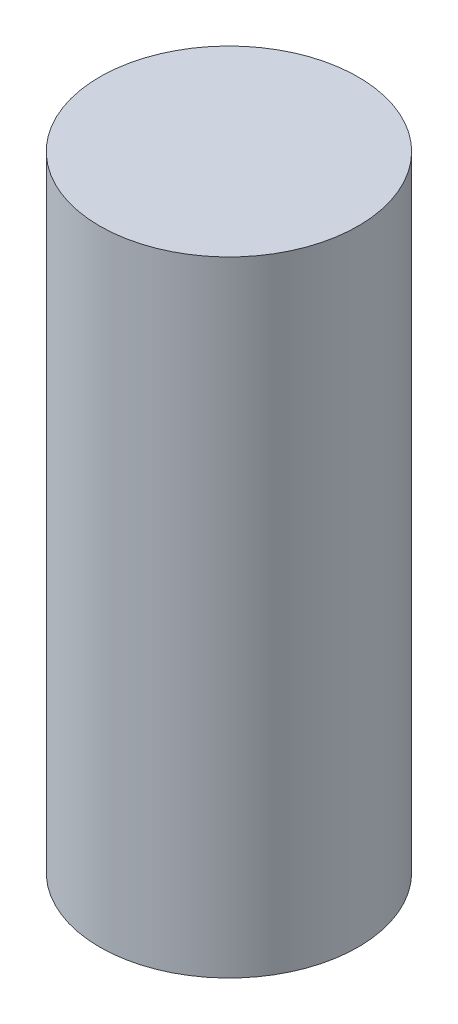
ISO-10303-21;
HEADER;
FILE_DESCRIPTION(('STEP AP214'),'2;1');
FILE_NAME('part.step','',(''),(''),'','','');
FILE_SCHEMA(('AUTOMOTIVE_DESIGN { 1 0 10303 214 1 1 1 1 }'));
ENDSEC;
DATA;
#1=APPLICATION_CONTEXT('core data for automotive mechanical design processes');
#2=APPLICATION_PROTOCOL_DEFINITION('international standard','automotive_design',2000,#1);
#3=PRODUCT_CONTEXT('',#1,'mechanical');
#4=PRODUCT('Part','Part','',(#3));
#5=PRODUCT_RELATED_PRODUCT_CATEGORY('part','',(#4));
#6=PRODUCT_DEFINITION_FORMATION('','',#4);
#7=PRODUCT_DEFINITION_CONTEXT('part definition',#1,'design');
#8=PRODUCT_DEFINITION('design','',#6,#7);
#9=PRODUCT_DEFINITION_SHAPE('','',#8);
#10=(LENGTH_UNIT() NAMED_UNIT(*) SI_UNIT(.MILLI.,.METRE.));
#11=(NAMED_UNIT(*) PLANE_ANGLE_UNIT() SI_UNIT($,.RADIAN.));
#12=(NAMED_UNIT(*) SI_UNIT($,.STERADIAN.) SOLID_ANGLE_UNIT());
#13=UNCERTAINTY_MEASURE_WITH_UNIT(LENGTH_MEASURE(1.E-05),#10,'distance_accuracy_value','');
#14=(GEOMETRIC_REPRESENTATION_CONTEXT(3) GLOBAL_UNCERTAINTY_ASSIGNED_CONTEXT((#13)) GLOBAL_UNIT_ASSIGNED_CONTEXT((#10,
#11,#12)) REPRESENTATION_CONTEXT('',''));
#15=CARTESIAN_POINT('',(0.,0.,0.));
#16=DIRECTION('',(0.,0.,1.));
#17=DIRECTION('',(1.,0.,0.));
#18=AXIS2_PLACEMENT_3D('',#15,#16,#17);
#19=CARTESIAN_POINT('',(0.,14.5,0.));
#20=DIRECTION('',(0.,-1.,0.));
#21=DIRECTION('',(0.,0.,-1.));
#22=AXIS2_PLACEMENT_3D('',#19,#20,#21);
#23=CYLINDRICAL_SURFACE('',#22,6.);
#24=CARTESIAN_POINT('',(0.,14.5,0.));
#25=DIRECTION('',(0.,1.,0.));
#26=DIRECTION('',(0.,0.,1.));
#27=AXIS2_PLACEMENT_3D('',#24,#25,#26);
#28=CIRCLE('',#27,6.);
#29=CARTESIAN_POINT('',(0.,14.5,6.));
#30=VERTEX_POINT('',#29);
#31=EDGE_CURVE('E10',#30,#30,#28,.T.);
#32=ORIENTED_EDGE('',*,*,#31,.F.);
#33=EDGE_LOOP('',(#32));
#34=FACE_BOUND('',#33,.T.);
#35=CARTESIAN_POINT('',(0.,-14.5,0.));
#36=DIRECTION('',(0.,1.,0.));
#37=DIRECTION('',(0.,0.,1.));
#38=AXIS2_PLACEMENT_3D('',#35,#36,#37);
#39=CIRCLE('',#38,6.);
#40=CARTESIAN_POINT('',(0.,-14.5,6.));
#41=VERTEX_POINT('',#40);
#42=EDGE_CURVE('E44',#41,#41,#39,.T.);
#43=ORIENTED_EDGE('',*,*,#42,.T.);
#44=EDGE_LOOP('',(#43));
#45=FACE_BOUND('',#44,.T.);
#46=ADVANCED_FACE('F41',(#34,#45),#23,.T.);
#47=CARTESIAN_POINT('',(0.,14.5,0.));
#48=DIRECTION('',(0.,1.,0.));
#49=DIRECTION('',(0.,0.,1.));
#50=AXIS2_PLACEMENT_3D('',#47,#48,#49);
#51=PLANE('',#50);
#52=ORIENTED_EDGE('',*,*,#31,.T.);
#53=EDGE_LOOP('',(#52));
#54=FACE_BOUND('',#53,.T.);
#55=ADVANCED_FACE('F56',(#54),#51,.T.);
#56=CARTESIAN_POINT('',(0.,-14.5,0.));
#57=DIRECTION('',(0.,1.,0.));
#58=DIRECTION('',(0.,0.,1.));
#59=AXIS2_PLACEMENT_3D('',#56,#57,#58);
#60=PLANE('',#59);
#61=ORIENTED_EDGE('',*,*,#42,.F.);
#62=EDGE_LOOP('',(#61));
#63=FACE_BOUND('',#62,.T.);
#64=ADVANCED_FACE('F54',(#63),#60,.F.);
#65=CLOSED_SHELL('',(#46,#55,#64));
#66=MANIFOLD_SOLID_BREP('B2',#65);
#67=ADVANCED_BREP_SHAPE_REPRESENTATION('',(#18,#66),#14);
#68=SHAPE_DEFINITION_REPRESENTATION(#9,#67);
ENDSEC;
END-ISO-10303-21;
